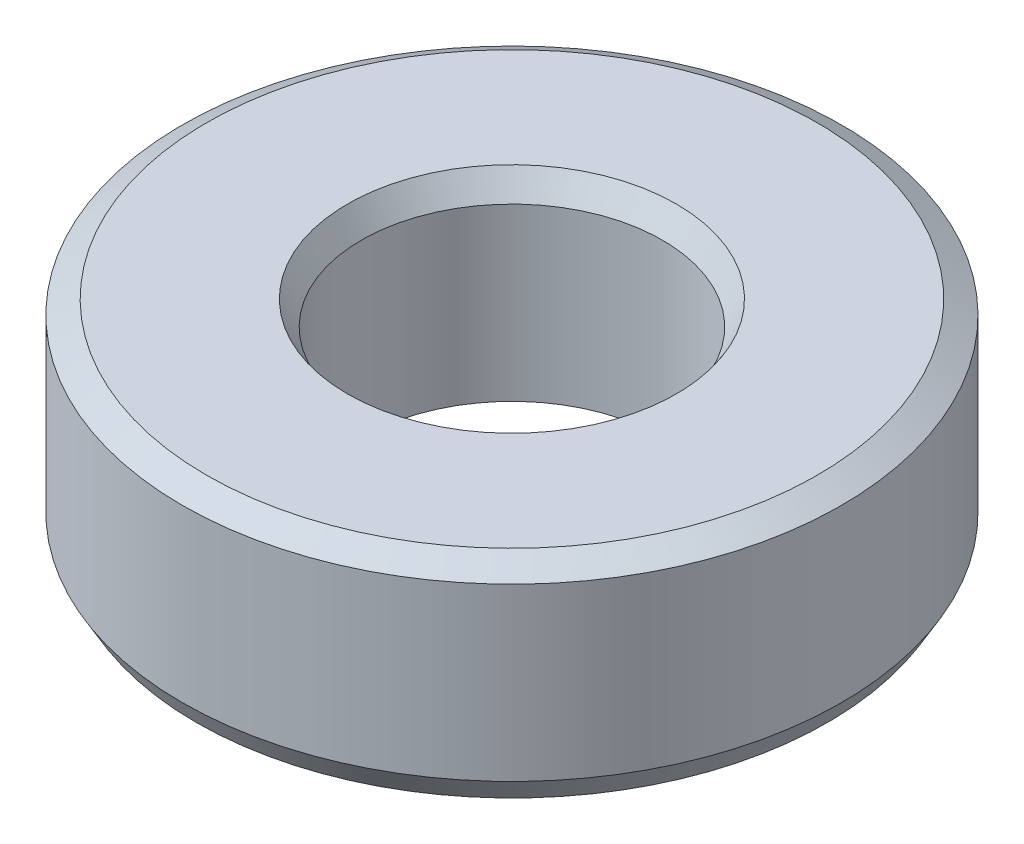
ISO-10303-21;
HEADER;
FILE_DESCRIPTION(('STEP AP214'),'2;1');
FILE_NAME('part.step','',(''),(''),'','','');
FILE_SCHEMA(('AUTOMOTIVE_DESIGN { 1 0 10303 214 1 1 1 1 }'));
ENDSEC;
DATA;
#1=APPLICATION_CONTEXT('core data for automotive mechanical design processes');
#2=APPLICATION_PROTOCOL_DEFINITION('international standard','automotive_design',2000,#1);
#3=PRODUCT_CONTEXT('',#1,'mechanical');
#4=PRODUCT('Part','Part','',(#3));
#5=PRODUCT_RELATED_PRODUCT_CATEGORY('part','',(#4));
#6=PRODUCT_DEFINITION_FORMATION('','',#4);
#7=PRODUCT_DEFINITION_CONTEXT('part definition',#1,'design');
#8=PRODUCT_DEFINITION('design','',#6,#7);
#9=PRODUCT_DEFINITION_SHAPE('','',#8);
#10=(LENGTH_UNIT() NAMED_UNIT(*) SI_UNIT(.MILLI.,.METRE.));
#11=(NAMED_UNIT(*) PLANE_ANGLE_UNIT() SI_UNIT($,.RADIAN.));
#12=(NAMED_UNIT(*) SI_UNIT($,.STERADIAN.) SOLID_ANGLE_UNIT());
#13=UNCERTAINTY_MEASURE_WITH_UNIT(LENGTH_MEASURE(1.E-05),#10,'distance_accuracy_value','');
#14=(GEOMETRIC_REPRESENTATION_CONTEXT(3) GLOBAL_UNCERTAINTY_ASSIGNED_CONTEXT((#13)) GLOBAL_UNIT_ASSIGNED_CONTEXT((#10,
#11,#12)) REPRESENTATION_CONTEXT('',''));
#15=CARTESIAN_POINT('',(0.,0.,0.));
#16=DIRECTION('',(0.,0.,1.));
#17=DIRECTION('',(1.,0.,0.));
#18=AXIS2_PLACEMENT_3D('',#15,#16,#17);
#19=CARTESIAN_POINT('',(0.,23.7889898849402,0.));
#20=DIRECTION('',(0.,-1.,0.));
#21=DIRECTION('',(0.,0.,-1.));
#22=AXIS2_PLACEMENT_3D('',#19,#20,#21);
#23=CYLINDRICAL_SURFACE('',#22,37.5);
#24=CARTESIAN_POINT('',(0.,2.75728217730264,0.));
#25=DIRECTION('',(0.,1.,0.));
#26=DIRECTION('',(0.,0.,1.));
#27=AXIS2_PLACEMENT_3D('',#24,#25,#26);
#28=CIRCLE('',#27,37.5);
#29=CARTESIAN_POINT('',(0.,2.75728217730264,37.5));
#30=VERTEX_POINT('',#29);
#31=EDGE_CURVE('E10',#30,#30,#28,.T.);
#32=ORIENTED_EDGE('',*,*,#31,.T.);
#33=EDGE_LOOP('',(#32));
#34=FACE_BOUND('',#33,.T.);
#35=CARTESIAN_POINT('',(0.,22.1970722776427,0.));
#36=DIRECTION('',(0.,1.,0.));
#37=DIRECTION('',(0.,0.,1.));
#38=AXIS2_PLACEMENT_3D('',#35,#36,#37);
#39=CIRCLE('',#38,37.5);
#40=CARTESIAN_POINT('',(0.,22.1970722776427,37.5));
#41=VERTEX_POINT('',#40);
#42=EDGE_CURVE('E50',#41,#41,#39,.F.);
#43=ORIENTED_EDGE('',*,*,#42,.T.);
#44=EDGE_LOOP('',(#43));
#45=FACE_BOUND('',#44,.T.);
#46=ADVANCED_FACE('F39',(#34,#45),#23,.T.);
#47=CARTESIAN_POINT('',(0.,23.7889898849402,0.));
#48=DIRECTION('',(0.,1.,0.));
#49=DIRECTION('',(0.,0.,1.));
#50=AXIS2_PLACEMENT_3D('',#47,#48,#49);
#51=PLANE('',#50);
#52=CARTESIAN_POINT('',(0.,23.7889898849402,0.));
#53=DIRECTION('',(0.,1.,0.));
#54=DIRECTION('',(0.,0.,1.));
#55=AXIS2_PLACEMENT_3D('',#52,#53,#54);
#56=CIRCLE('',#55,18.714901589959);
#57=CARTESIAN_POINT('',(0.,23.7889898849402,18.714901589959));
#58=VERTEX_POINT('',#57);
#59=EDGE_CURVE('E58',#58,#58,#56,.F.);
#60=ORIENTED_EDGE('',*,*,#59,.T.);
#61=EDGE_LOOP('',(#60));
#62=FACE_BOUND('',#61,.T.);
#63=CARTESIAN_POINT('',(0.,23.7889898849402,0.));
#64=DIRECTION('',(0.,1.,0.));
#65=DIRECTION('',(0.,0.,1.));
#66=AXIS2_PLACEMENT_3D('',#63,#64,#65);
#67=CIRCLE('',#66,34.7427178226974);
#68=CARTESIAN_POINT('',(0.,23.7889898849402,34.7427178226974));
#69=VERTEX_POINT('',#68);
#70=EDGE_CURVE('E61',#69,#69,#67,.T.);
#71=ORIENTED_EDGE('',*,*,#70,.T.);
#72=EDGE_LOOP('',(#71));
#73=FACE_BOUND('',#72,.T.);
#74=ADVANCED_FACE('F88',(#62,#73),#51,.T.);
#75=CARTESIAN_POINT('',(0.,0.,0.));
#76=DIRECTION('',(0.,1.,0.));
#77=DIRECTION('',(0.,0.,1.));
#78=AXIS2_PLACEMENT_3D('',#75,#76,#77);
#79=PLANE('',#78);
#80=CARTESIAN_POINT('',(0.,0.,0.));
#81=DIRECTION('',(0.,1.,0.));
#82=DIRECTION('',(0.,0.,1.));
#83=AXIS2_PLACEMENT_3D('',#80,#81,#82);
#84=CIRCLE('',#83,19.8802661599642);
#85=CARTESIAN_POINT('',(0.,0.,19.8802661599642));
#86=VERTEX_POINT('',#85);
#87=EDGE_CURVE('E51',#86,#86,#84,.T.);
#88=ORIENTED_EDGE('',*,*,#87,.T.);
#89=EDGE_LOOP('',(#88));
#90=FACE_BOUND('',#89,.T.);
#91=CARTESIAN_POINT('',(0.,0.,0.));
#92=DIRECTION('',(0.,1.,0.));
#93=DIRECTION('',(0.,0.,1.));
#94=AXIS2_PLACEMENT_3D('',#91,#92,#93);
#95=CIRCLE('',#94,35.9080823927026);
#96=CARTESIAN_POINT('',(0.,0.,35.9080823927026));
#97=VERTEX_POINT('',#96);
#98=EDGE_CURVE('E54',#97,#97,#95,.F.);
#99=ORIENTED_EDGE('',*,*,#98,.T.);
#100=EDGE_LOOP('',(#99));
#101=FACE_BOUND('',#100,.T.);
#102=ADVANCED_FACE('F83',(#90,#101),#79,.F.);
#103=CARTESIAN_POINT('',(0.,23.7889898849402,0.));
#104=DIRECTION('',(0.,-1.,0.));
#105=DIRECTION('',(0.,0.,-1.));
#106=AXIS2_PLACEMENT_3D('',#103,#104,#105);
#107=CYLINDRICAL_SURFACE('',#106,17.1229839826616);
#108=CARTESIAN_POINT('',(0.,21.0317077076375,0.));
#109=DIRECTION('',(0.,1.,0.));
#110=DIRECTION('',(0.,0.,1.));
#111=AXIS2_PLACEMENT_3D('',#108,#109,#110);
#112=CIRCLE('',#111,17.1229839826616);
#113=CARTESIAN_POINT('',(0.,21.0317077076375,17.1229839826616));
#114=VERTEX_POINT('',#113);
#115=EDGE_CURVE('E67',#114,#114,#112,.T.);
#116=ORIENTED_EDGE('',*,*,#115,.T.);
#117=EDGE_LOOP('',(#116));
#118=FACE_BOUND('',#117,.T.);
#119=CARTESIAN_POINT('',(0.,1.59191760729746,0.));
#120=DIRECTION('',(0.,1.,0.));
#121=DIRECTION('',(0.,0.,1.));
#122=AXIS2_PLACEMENT_3D('',#119,#120,#121);
#123=CIRCLE('',#122,17.1229839826616);
#124=CARTESIAN_POINT('',(0.,1.59191760729746,17.1229839826616));
#125=VERTEX_POINT('',#124);
#126=EDGE_CURVE('E69',#125,#125,#123,.F.);
#127=ORIENTED_EDGE('',*,*,#126,.T.);
#128=EDGE_LOOP('',(#127));
#129=FACE_BOUND('',#128,.T.);
#130=ADVANCED_FACE('F71',(#118,#129),#107,.F.);
#131=CARTESIAN_POINT('',(0.,21.0317077076375,0.));
#132=DIRECTION('',(0.,1.,0.));
#133=DIRECTION('',(0.,0.,1.));
#134=AXIS2_PLACEMENT_3D('',#131,#132,#133);
#135=CONICAL_SURFACE('',#134,17.1229839826616,0.523598775598302);
#136=ORIENTED_EDGE('',*,*,#59,.F.);
#137=EDGE_LOOP('',(#136));
#138=FACE_BOUND('',#137,.T.);
#139=ORIENTED_EDGE('',*,*,#115,.F.);
#140=EDGE_LOOP('',(#139));
#141=FACE_BOUND('',#140,.T.);
#142=ADVANCED_FACE('F77',(#138,#141),#135,.F.);
#143=CARTESIAN_POINT('',(0.,0.,0.));
#144=DIRECTION('',(0.,-1.,0.));
#145=DIRECTION('',(0.,0.,-1.));
#146=AXIS2_PLACEMENT_3D('',#143,#144,#145);
#147=CONICAL_SURFACE('',#146,19.8802661599642,1.04719755119659);
#148=ORIENTED_EDGE('',*,*,#126,.F.);
#149=EDGE_LOOP('',(#148));
#150=FACE_BOUND('',#149,.T.);
#151=ORIENTED_EDGE('',*,*,#87,.F.);
#152=EDGE_LOOP('',(#151));
#153=FACE_BOUND('',#152,.T.);
#154=ADVANCED_FACE('F73',(#150,#153),#147,.F.);
#155=CARTESIAN_POINT('',(0.,2.75728217730264,0.));
#156=DIRECTION('',(0.,1.,0.));
#157=DIRECTION('',(0.,0.,1.));
#158=AXIS2_PLACEMENT_3D('',#155,#156,#157);
#159=CONICAL_SURFACE('',#158,37.5,0.5235987755983);
#160=ORIENTED_EDGE('',*,*,#98,.F.);
#161=EDGE_LOOP('',(#160));
#162=FACE_BOUND('',#161,.T.);
#163=ORIENTED_EDGE('',*,*,#31,.F.);
#164=EDGE_LOOP('',(#163));
#165=FACE_BOUND('',#164,.T.);
#166=ADVANCED_FACE('F76',(#162,#165),#159,.T.);
#167=CARTESIAN_POINT('',(0.,23.7889898849402,0.));
#168=DIRECTION('',(0.,-1.,0.));
#169=DIRECTION('',(0.,0.,-1.));
#170=AXIS2_PLACEMENT_3D('',#167,#168,#169);
#171=CONICAL_SURFACE('',#170,34.7427178226974,1.04719755119659);
#172=ORIENTED_EDGE('',*,*,#42,.F.);
#173=EDGE_LOOP('',(#172));
#174=FACE_BOUND('',#173,.T.);
#175=ORIENTED_EDGE('',*,*,#70,.F.);
#176=EDGE_LOOP('',(#175));
#177=FACE_BOUND('',#176,.T.);
#178=ADVANCED_FACE('F45',(#174,#177),#171,.T.);
#179=CLOSED_SHELL('',(#46,#74,#102,#130,#142,#154,#166,#178));
#180=MANIFOLD_SOLID_BREP('B2',#179);
#181=ADVANCED_BREP_SHAPE_REPRESENTATION('',(#18,#180),#14);
#182=SHAPE_DEFINITION_REPRESENTATION(#9,#181);
ENDSEC;
END-ISO-10303-21;
